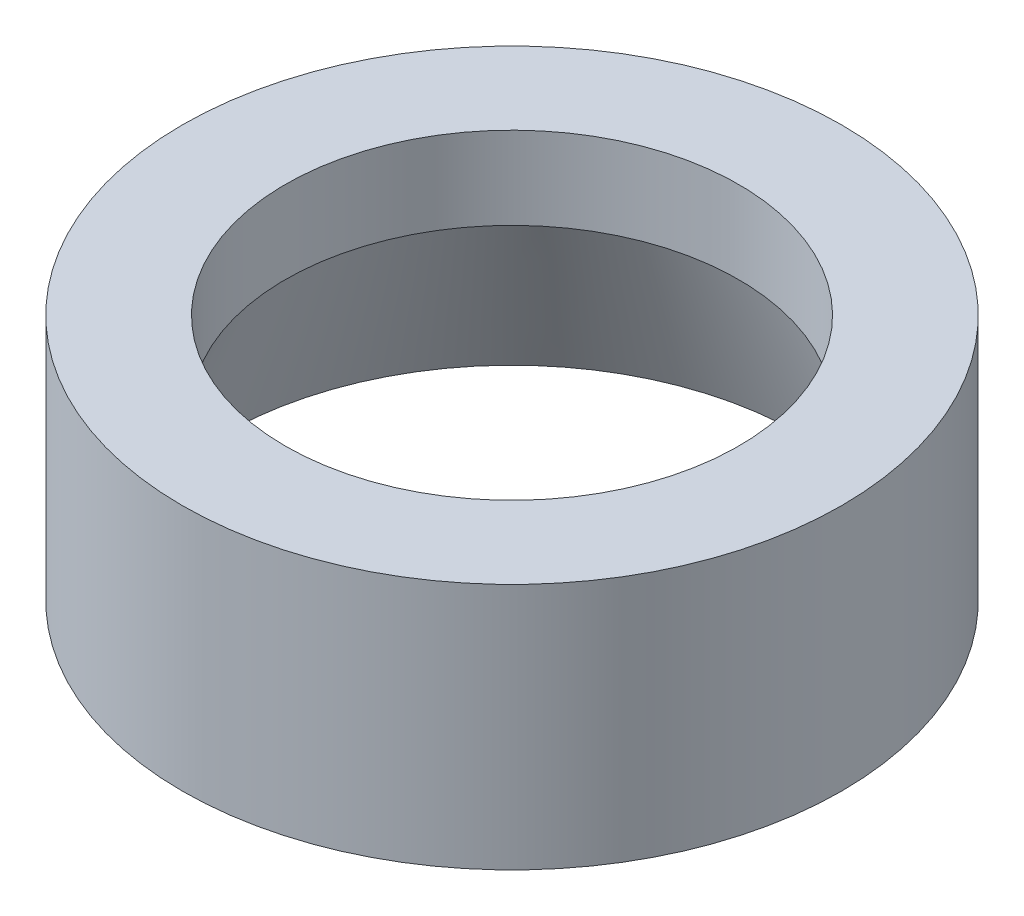
ISO-10303-21;
HEADER;
FILE_DESCRIPTION(('STEP AP214'),'2;1');
FILE_NAME('part.step','',(''),(''),'','','');
FILE_SCHEMA(('AUTOMOTIVE_DESIGN { 1 0 10303 214 1 1 1 1 }'));
ENDSEC;
DATA;
#1=APPLICATION_CONTEXT('core data for automotive mechanical design processes');
#2=APPLICATION_PROTOCOL_DEFINITION('international standard','automotive_design',2000,#1);
#3=PRODUCT_CONTEXT('',#1,'mechanical');
#4=PRODUCT('Part','Part','',(#3));
#5=PRODUCT_RELATED_PRODUCT_CATEGORY('part','',(#4));
#6=PRODUCT_DEFINITION_FORMATION('','',#4);
#7=PRODUCT_DEFINITION_CONTEXT('part definition',#1,'design');
#8=PRODUCT_DEFINITION('design','',#6,#7);
#9=PRODUCT_DEFINITION_SHAPE('','',#8);
#10=(LENGTH_UNIT() NAMED_UNIT(*) SI_UNIT(.MILLI.,.METRE.));
#11=(NAMED_UNIT(*) PLANE_ANGLE_UNIT() SI_UNIT($,.RADIAN.));
#12=(NAMED_UNIT(*) SI_UNIT($,.STERADIAN.) SOLID_ANGLE_UNIT());
#13=UNCERTAINTY_MEASURE_WITH_UNIT(LENGTH_MEASURE(1.E-05),#10,'distance_accuracy_value','');
#14=(GEOMETRIC_REPRESENTATION_CONTEXT(3) GLOBAL_UNCERTAINTY_ASSIGNED_CONTEXT((#13)) GLOBAL_UNIT_ASSIGNED_CONTEXT((#10,
#11,#12)) REPRESENTATION_CONTEXT('',''));
#15=CARTESIAN_POINT('',(0.,0.,0.));
#16=DIRECTION('',(0.,0.,1.));
#17=DIRECTION('',(1.,0.,0.));
#18=AXIS2_PLACEMENT_3D('',#15,#16,#17);
#19=CARTESIAN_POINT('',(2.75,1.5,0.));
#20=DIRECTION('',(0.,-1.,0.));
#21=DIRECTION('',(0.,0.,-1.));
#22=AXIS2_PLACEMENT_3D('',#19,#20,#21);
#23=PLANE('',#22);
#24=CARTESIAN_POINT('',(0.,1.5,0.));
#25=DIRECTION('',(0.,1.,0.));
#26=DIRECTION('',(0.,0.,1.));
#27=AXIS2_PLACEMENT_3D('',#24,#25,#26);
#28=CIRCLE('',#27,2.75);
#29=CARTESIAN_POINT('',(0.,1.5,2.75));
#30=VERTEX_POINT('',#29);
#31=EDGE_CURVE('E47',#30,#30,#28,.T.);
#32=ORIENTED_EDGE('',*,*,#31,.F.);
#33=EDGE_LOOP('',(#32));
#34=FACE_BOUND('',#33,.T.);
#35=CARTESIAN_POINT('',(0.,1.5,0.));
#36=DIRECTION('',(0.,1.,0.));
#37=DIRECTION('',(0.,0.,1.));
#38=AXIS2_PLACEMENT_3D('',#35,#36,#37);
#39=CIRCLE('',#38,4.);
#40=CARTESIAN_POINT('',(0.,1.5,4.));
#41=VERTEX_POINT('',#40);
#42=EDGE_CURVE('E10',#41,#41,#39,.T.);
#43=ORIENTED_EDGE('',*,*,#42,.T.);
#44=EDGE_LOOP('',(#43));
#45=FACE_BOUND('',#44,.T.);
#46=ADVANCED_FACE('F28',(#34,#45),#23,.F.);
#47=CARTESIAN_POINT('',(0.,1.5,0.));
#48=DIRECTION('',(0.,1.,0.));
#49=DIRECTION('',(0.,0.,1.));
#50=AXIS2_PLACEMENT_3D('',#47,#48,#49);
#51=CYLINDRICAL_SURFACE('',#50,4.);
#52=ORIENTED_EDGE('',*,*,#42,.F.);
#53=EDGE_LOOP('',(#52));
#54=FACE_BOUND('',#53,.T.);
#55=CARTESIAN_POINT('',(0.,-1.5,0.));
#56=DIRECTION('',(0.,1.,0.));
#57=DIRECTION('',(0.,0.,1.));
#58=AXIS2_PLACEMENT_3D('',#55,#56,#57);
#59=CIRCLE('',#58,4.);
#60=CARTESIAN_POINT('',(0.,-1.5,4.));
#61=VERTEX_POINT('',#60);
#62=EDGE_CURVE('E34',#61,#61,#59,.T.);
#63=ORIENTED_EDGE('',*,*,#62,.T.);
#64=EDGE_LOOP('',(#63));
#65=FACE_BOUND('',#64,.T.);
#66=ADVANCED_FACE('F54',(#54,#65),#51,.T.);
#67=CARTESIAN_POINT('',(4.,-1.5,0.));
#68=DIRECTION('',(0.,1.,0.));
#69=DIRECTION('',(0.,0.,1.));
#70=AXIS2_PLACEMENT_3D('',#67,#68,#69);
#71=PLANE('',#70);
#72=ORIENTED_EDGE('',*,*,#62,.F.);
#73=EDGE_LOOP('',(#72));
#74=FACE_BOUND('',#73,.T.);
#75=CARTESIAN_POINT('',(0.,-1.5,0.));
#76=DIRECTION('',(0.,1.,0.));
#77=DIRECTION('',(0.,0.,1.));
#78=AXIS2_PLACEMENT_3D('',#75,#76,#77);
#79=CIRCLE('',#78,3.5);
#80=CARTESIAN_POINT('',(0.,-1.5,3.5));
#81=VERTEX_POINT('',#80);
#82=EDGE_CURVE('E38',#81,#81,#79,.T.);
#83=ORIENTED_EDGE('',*,*,#82,.T.);
#84=EDGE_LOOP('',(#83));
#85=FACE_BOUND('',#84,.T.);
#86=ADVANCED_FACE('F58',(#74,#85),#71,.F.);
#87=CARTESIAN_POINT('',(0.,0.5,0.));
#88=DIRECTION('',(0.,-1.,0.));
#89=DIRECTION('',(0.,0.,-1.));
#90=AXIS2_PLACEMENT_3D('',#87,#88,#89);
#91=CONICAL_SURFACE('',#90,2.75,0.358770670270572);
#92=ORIENTED_EDGE('',*,*,#82,.F.);
#93=EDGE_LOOP('',(#92));
#94=FACE_BOUND('',#93,.T.);
#95=CARTESIAN_POINT('',(0.,0.5,0.));
#96=DIRECTION('',(0.,1.,0.));
#97=DIRECTION('',(0.,0.,1.));
#98=AXIS2_PLACEMENT_3D('',#95,#96,#97);
#99=CIRCLE('',#98,2.75);
#100=CARTESIAN_POINT('',(0.,0.5,2.75));
#101=VERTEX_POINT('',#100);
#102=EDGE_CURVE('E42',#101,#101,#99,.T.);
#103=ORIENTED_EDGE('',*,*,#102,.T.);
#104=EDGE_LOOP('',(#103));
#105=FACE_BOUND('',#104,.T.);
#106=ADVANCED_FACE('F63',(#94,#105),#91,.F.);
#107=CARTESIAN_POINT('',(0.,1.5,0.));
#108=DIRECTION('',(0.,1.,0.));
#109=DIRECTION('',(0.,0.,1.));
#110=AXIS2_PLACEMENT_3D('',#107,#108,#109);
#111=CYLINDRICAL_SURFACE('',#110,2.75);
#112=ORIENTED_EDGE('',*,*,#102,.F.);
#113=EDGE_LOOP('',(#112));
#114=FACE_BOUND('',#113,.T.);
#115=ORIENTED_EDGE('',*,*,#31,.T.);
#116=EDGE_LOOP('',(#115));
#117=FACE_BOUND('',#116,.T.);
#118=ADVANCED_FACE('F51',(#114,#117),#111,.F.);
#119=CLOSED_SHELL('',(#46,#66,#86,#106,#118));
#120=MANIFOLD_SOLID_BREP('B2',#119);
#121=ADVANCED_BREP_SHAPE_REPRESENTATION('',(#18,#120),#14);
#122=SHAPE_DEFINITION_REPRESENTATION(#9,#121);
ENDSEC;
END-ISO-10303-21;
